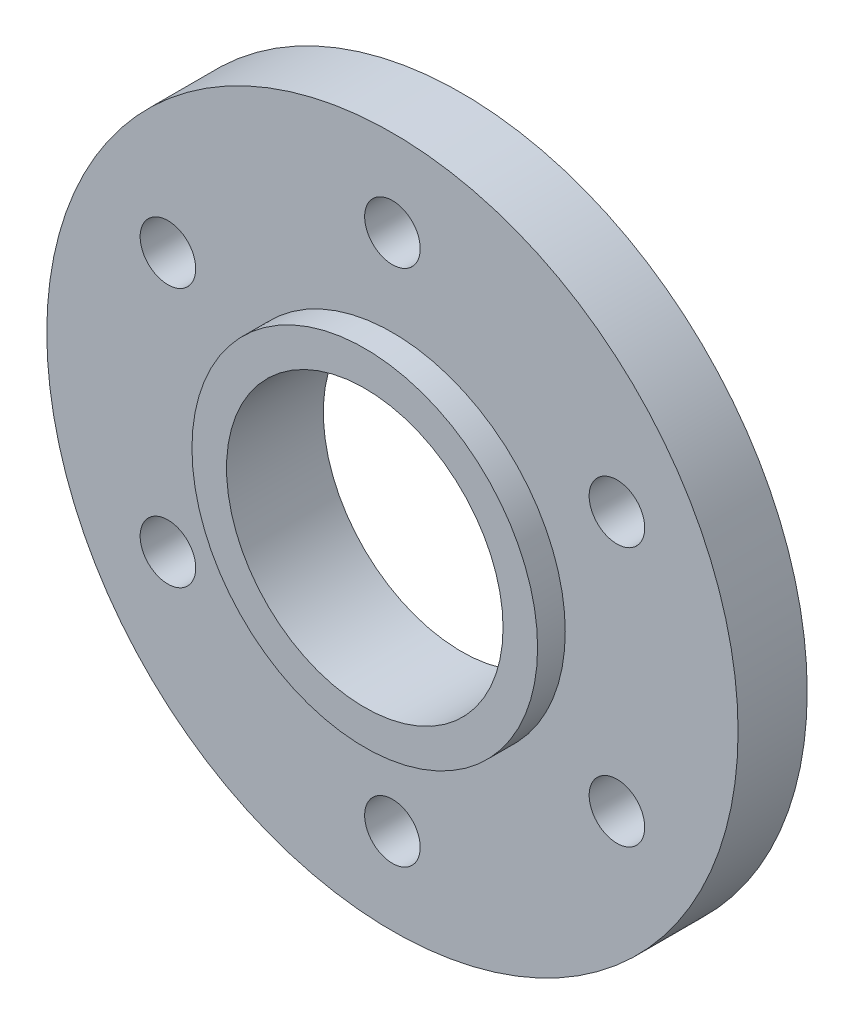
ISO-10303-21;
HEADER;
FILE_DESCRIPTION(('STEP AP214'),'2;1');
FILE_NAME('part.step','',(''),(''),'','','');
FILE_SCHEMA(('AUTOMOTIVE_DESIGN { 1 0 10303 214 1 1 1 1 }'));
ENDSEC;
DATA;
#1=APPLICATION_CONTEXT('core data for automotive mechanical design processes');
#2=APPLICATION_PROTOCOL_DEFINITION('international standard','automotive_design',2000,#1);
#3=PRODUCT_CONTEXT('',#1,'mechanical');
#4=PRODUCT('Part','Part','',(#3));
#5=PRODUCT_RELATED_PRODUCT_CATEGORY('part','',(#4));
#6=PRODUCT_DEFINITION_FORMATION('','',#4);
#7=PRODUCT_DEFINITION_CONTEXT('part definition',#1,'design');
#8=PRODUCT_DEFINITION('design','',#6,#7);
#9=PRODUCT_DEFINITION_SHAPE('','',#8);
#10=(LENGTH_UNIT() NAMED_UNIT(*) SI_UNIT(.MILLI.,.METRE.));
#11=(NAMED_UNIT(*) PLANE_ANGLE_UNIT() SI_UNIT($,.RADIAN.));
#12=(NAMED_UNIT(*) SI_UNIT($,.STERADIAN.) SOLID_ANGLE_UNIT());
#13=UNCERTAINTY_MEASURE_WITH_UNIT(LENGTH_MEASURE(1.E-05),#10,'distance_accuracy_value','');
#14=(GEOMETRIC_REPRESENTATION_CONTEXT(3) GLOBAL_UNCERTAINTY_ASSIGNED_CONTEXT((#13)) GLOBAL_UNIT_ASSIGNED_CONTEXT((#10,
#11,#12)) REPRESENTATION_CONTEXT('',''));
#15=CARTESIAN_POINT('',(0.,0.,0.));
#16=DIRECTION('',(0.,0.,1.));
#17=DIRECTION('',(1.,0.,0.));
#18=AXIS2_PLACEMENT_3D('',#15,#16,#17);
#19=CARTESIAN_POINT('',(0.,0.,6.35));
#20=DIRECTION('',(0.,0.,1.));
#21=DIRECTION('',(1.,0.,0.));
#22=AXIS2_PLACEMENT_3D('',#19,#20,#21);
#23=PLANE('',#22);
#24=CARTESIAN_POINT('',(0.,0.,6.35));
#25=DIRECTION('',(0.,0.,1.));
#26=DIRECTION('',(1.,0.,0.));
#27=AXIS2_PLACEMENT_3D('',#24,#25,#26);
#28=CIRCLE('',#27,31.75);
#29=CARTESIAN_POINT('',(31.75,0.,6.35));
#30=VERTEX_POINT('',#29);
#31=EDGE_CURVE('E10',#30,#30,#28,.T.);
#32=ORIENTED_EDGE('',*,*,#31,.T.);
#33=EDGE_LOOP('',(#32));
#34=FACE_BOUND('',#33,.T.);
#35=CARTESIAN_POINT('',(0.,23.8125,6.35));
#36=DIRECTION('',(0.,0.,1.));
#37=DIRECTION('',(1.,0.,0.));
#38=AXIS2_PLACEMENT_3D('',#35,#36,#37);
#39=CIRCLE('',#38,2.5527);
#40=CARTESIAN_POINT('',(2.5527,23.8125,6.35));
#41=VERTEX_POINT('',#40);
#42=EDGE_CURVE('E47',#41,#41,#39,.T.);
#43=ORIENTED_EDGE('',*,*,#42,.F.);
#44=EDGE_LOOP('',(#43));
#45=FACE_BOUND('',#44,.T.);
#46=CARTESIAN_POINT('',(20.6222299276176,11.9062500000012,6.35));
#47=DIRECTION('',(0.,0.,1.));
#48=DIRECTION('',(1.,0.,0.));
#49=AXIS2_PLACEMENT_3D('',#46,#47,#48);
#50=CIRCLE('',#49,2.55270000000037);
#51=CARTESIAN_POINT('',(23.174929927618,11.9062500000012,6.35));
#52=VERTEX_POINT('',#51);
#53=EDGE_CURVE('E53',#52,#52,#50,.T.);
#54=ORIENTED_EDGE('',*,*,#53,.F.);
#55=EDGE_LOOP('',(#54));
#56=FACE_BOUND('',#55,.T.);
#57=CARTESIAN_POINT('',(20.622229927619,-11.9062499999988,6.35));
#58=DIRECTION('',(0.,0.,1.));
#59=DIRECTION('',(1.,0.,0.));
#60=AXIS2_PLACEMENT_3D('',#57,#58,#59);
#61=CIRCLE('',#60,2.55270000000171);
#62=CARTESIAN_POINT('',(23.1749299276207,-11.9062499999988,6.35));
#63=VERTEX_POINT('',#62);
#64=EDGE_CURVE('E59',#63,#63,#61,.T.);
#65=ORIENTED_EDGE('',*,*,#64,.F.);
#66=EDGE_LOOP('',(#65));
#67=FACE_BOUND('',#66,.T.);
#68=CARTESIAN_POINT('',(2.70133544286504E-12,-23.8125,6.35));
#69=DIRECTION('',(0.,0.,1.));
#70=DIRECTION('',(1.,0.,0.));
#71=AXIS2_PLACEMENT_3D('',#68,#69,#70);
#72=CIRCLE('',#71,2.55270000000274);
#73=CARTESIAN_POINT('',(2.55270000000544,-23.8125,6.35));
#74=VERTEX_POINT('',#73);
#75=EDGE_CURVE('E65',#74,#74,#72,.T.);
#76=ORIENTED_EDGE('',*,*,#75,.F.);
#77=EDGE_LOOP('',(#76));
#78=FACE_BOUND('',#77,.T.);
#79=CARTESIAN_POINT('',(-20.6222299276149,-11.9062500000012,6.35));
#80=DIRECTION('',(0.,0.,1.));
#81=DIRECTION('',(1.,0.,0.));
#82=AXIS2_PLACEMENT_3D('',#79,#80,#81);
#83=CIRCLE('',#82,2.5527000000025);
#84=CARTESIAN_POINT('',(-18.0695299276124,-11.9062500000012,6.35));
#85=VERTEX_POINT('',#84);
#86=EDGE_CURVE('E71',#85,#85,#83,.T.);
#87=ORIENTED_EDGE('',*,*,#86,.F.);
#88=EDGE_LOOP('',(#87));
#89=FACE_BOUND('',#88,.T.);
#90=CARTESIAN_POINT('',(-20.6222299276163,11.9062499999988,6.35));
#91=DIRECTION('',(0.,0.,1.));
#92=DIRECTION('',(1.,0.,0.));
#93=AXIS2_PLACEMENT_3D('',#90,#91,#92);
#94=CIRCLE('',#93,2.55270000000127);
#95=CARTESIAN_POINT('',(-18.069529927615,11.9062499999988,6.35));
#96=VERTEX_POINT('',#95);
#97=EDGE_CURVE('E77',#96,#96,#94,.T.);
#98=ORIENTED_EDGE('',*,*,#97,.F.);
#99=EDGE_LOOP('',(#98));
#100=FACE_BOUND('',#99,.T.);
#101=CARTESIAN_POINT('',(0.,0.,6.35));
#102=DIRECTION('',(0.,0.,1.));
#103=DIRECTION('',(1.,0.,0.));
#104=AXIS2_PLACEMENT_3D('',#101,#102,#103);
#105=CIRCLE('',#104,15.875);
#106=CARTESIAN_POINT('',(15.875,0.,6.35));
#107=VERTEX_POINT('',#106);
#108=EDGE_CURVE('E83',#107,#107,#105,.T.);
#109=ORIENTED_EDGE('',*,*,#108,.F.);
#110=EDGE_LOOP('',(#109));
#111=FACE_BOUND('',#110,.T.);
#112=ADVANCED_FACE('F31',(#34,#45,#56,#67,#78,#89,#100,#111),#23,.T.);
#113=CARTESIAN_POINT('',(0.,0.,6.35));
#114=DIRECTION('',(0.,0.,-1.));
#115=DIRECTION('',(-1.,0.,0.));
#116=AXIS2_PLACEMENT_3D('',#113,#114,#115);
#117=CYLINDRICAL_SURFACE('',#116,31.75);
#118=ORIENTED_EDGE('',*,*,#31,.F.);
#119=EDGE_LOOP('',(#118));
#120=FACE_BOUND('',#119,.T.);
#121=CARTESIAN_POINT('',(0.,0.,0.));
#122=DIRECTION('',(0.,0.,1.));
#123=DIRECTION('',(1.,0.,0.));
#124=AXIS2_PLACEMENT_3D('',#121,#122,#123);
#125=CIRCLE('',#124,31.75);
#126=CARTESIAN_POINT('',(31.75,0.,0.));
#127=VERTEX_POINT('',#126);
#128=EDGE_CURVE('E35',#127,#127,#125,.T.);
#129=ORIENTED_EDGE('',*,*,#128,.T.);
#130=EDGE_LOOP('',(#129));
#131=FACE_BOUND('',#130,.T.);
#132=ADVANCED_FACE('F33',(#120,#131),#117,.T.);
#133=CARTESIAN_POINT('',(0.,0.,0.));
#134=DIRECTION('',(0.,0.,1.));
#135=DIRECTION('',(1.,0.,0.));
#136=AXIS2_PLACEMENT_3D('',#133,#134,#135);
#137=PLANE('',#136);
#138=CARTESIAN_POINT('',(-20.6222299276163,11.9062499999988,0.));
#139=DIRECTION('',(0.,0.,1.));
#140=DIRECTION('',(1.,0.,0.));
#141=AXIS2_PLACEMENT_3D('',#138,#139,#140);
#142=CIRCLE('',#141,2.55270000000127);
#143=CARTESIAN_POINT('',(-18.069529927615,11.9062499999988,0.));
#144=VERTEX_POINT('',#143);
#145=EDGE_CURVE('E74',#144,#144,#142,.T.);
#146=ORIENTED_EDGE('',*,*,#145,.T.);
#147=EDGE_LOOP('',(#146));
#148=FACE_BOUND('',#147,.T.);
#149=CARTESIAN_POINT('',(-20.6222299276149,-11.9062500000012,0.));
#150=DIRECTION('',(0.,0.,1.));
#151=DIRECTION('',(1.,0.,0.));
#152=AXIS2_PLACEMENT_3D('',#149,#150,#151);
#153=CIRCLE('',#152,2.5527000000025);
#154=CARTESIAN_POINT('',(-18.0695299276124,-11.9062500000012,0.));
#155=VERTEX_POINT('',#154);
#156=EDGE_CURVE('E68',#155,#155,#153,.T.);
#157=ORIENTED_EDGE('',*,*,#156,.T.);
#158=EDGE_LOOP('',(#157));
#159=FACE_BOUND('',#158,.T.);
#160=CARTESIAN_POINT('',(2.70133544286504E-12,-23.8125,0.));
#161=DIRECTION('',(0.,0.,1.));
#162=DIRECTION('',(1.,0.,0.));
#163=AXIS2_PLACEMENT_3D('',#160,#161,#162);
#164=CIRCLE('',#163,2.55270000000274);
#165=CARTESIAN_POINT('',(2.55270000000544,-23.8125,0.));
#166=VERTEX_POINT('',#165);
#167=EDGE_CURVE('E62',#166,#166,#164,.T.);
#168=ORIENTED_EDGE('',*,*,#167,.T.);
#169=EDGE_LOOP('',(#168));
#170=FACE_BOUND('',#169,.T.);
#171=CARTESIAN_POINT('',(20.622229927619,-11.9062499999988,0.));
#172=DIRECTION('',(0.,0.,1.));
#173=DIRECTION('',(1.,0.,0.));
#174=AXIS2_PLACEMENT_3D('',#171,#172,#173);
#175=CIRCLE('',#174,2.55270000000171);
#176=CARTESIAN_POINT('',(23.1749299276207,-11.9062499999988,0.));
#177=VERTEX_POINT('',#176);
#178=EDGE_CURVE('E56',#177,#177,#175,.T.);
#179=ORIENTED_EDGE('',*,*,#178,.T.);
#180=EDGE_LOOP('',(#179));
#181=FACE_BOUND('',#180,.T.);
#182=CARTESIAN_POINT('',(20.6222299276176,11.9062500000012,0.));
#183=DIRECTION('',(0.,0.,1.));
#184=DIRECTION('',(1.,0.,0.));
#185=AXIS2_PLACEMENT_3D('',#182,#183,#184);
#186=CIRCLE('',#185,2.55270000000037);
#187=CARTESIAN_POINT('',(23.174929927618,11.9062500000012,0.));
#188=VERTEX_POINT('',#187);
#189=EDGE_CURVE('E50',#188,#188,#186,.T.);
#190=ORIENTED_EDGE('',*,*,#189,.T.);
#191=EDGE_LOOP('',(#190));
#192=FACE_BOUND('',#191,.T.);
#193=CARTESIAN_POINT('',(0.,23.8125,0.));
#194=DIRECTION('',(0.,0.,1.));
#195=DIRECTION('',(1.,0.,0.));
#196=AXIS2_PLACEMENT_3D('',#193,#194,#195);
#197=CIRCLE('',#196,2.5527);
#198=CARTESIAN_POINT('',(2.5527,23.8125,0.));
#199=VERTEX_POINT('',#198);
#200=EDGE_CURVE('E46',#199,#199,#197,.T.);
#201=ORIENTED_EDGE('',*,*,#200,.T.);
#202=EDGE_LOOP('',(#201));
#203=FACE_BOUND('',#202,.T.);
#204=CARTESIAN_POINT('',(0.,0.,0.));
#205=DIRECTION('',(0.,0.,1.));
#206=DIRECTION('',(1.,0.,0.));
#207=AXIS2_PLACEMENT_3D('',#204,#205,#206);
#208=CIRCLE('',#207,12.7);
#209=CARTESIAN_POINT('',(12.7,0.,0.));
#210=VERTEX_POINT('',#209);
#211=EDGE_CURVE('E42',#210,#210,#208,.T.);
#212=ORIENTED_EDGE('',*,*,#211,.T.);
#213=EDGE_LOOP('',(#212));
#214=FACE_BOUND('',#213,.T.);
#215=ORIENTED_EDGE('',*,*,#128,.F.);
#216=EDGE_LOOP('',(#215));
#217=FACE_BOUND('',#216,.T.);
#218=ADVANCED_FACE('F114',(#148,#159,#170,#181,#192,#203,#214,#217),#137,.F.);
#219=CARTESIAN_POINT('',(0.,0.,0.));
#220=DIRECTION('',(0.,0.,1.));
#221=DIRECTION('',(1.,0.,0.));
#222=AXIS2_PLACEMENT_3D('',#219,#220,#221);
#223=CYLINDRICAL_SURFACE('',#222,12.7);
#224=ORIENTED_EDGE('',*,*,#211,.F.);
#225=EDGE_LOOP('',(#224));
#226=FACE_BOUND('',#225,.T.);
#227=CARTESIAN_POINT('',(0.,0.,8.89));
#228=DIRECTION('',(0.,0.,1.));
#229=DIRECTION('',(1.,0.,0.));
#230=AXIS2_PLACEMENT_3D('',#227,#228,#229);
#231=CIRCLE('',#230,12.7);
#232=CARTESIAN_POINT('',(12.7,0.,8.89));
#233=VERTEX_POINT('',#232);
#234=EDGE_CURVE('E86',#233,#233,#231,.T.);
#235=ORIENTED_EDGE('',*,*,#234,.T.);
#236=EDGE_LOOP('',(#235));
#237=FACE_BOUND('',#236,.T.);
#238=ADVANCED_FACE('F92',(#226,#237),#223,.F.);
#239=CARTESIAN_POINT('',(0.,23.8125,0.));
#240=DIRECTION('',(0.,0.,1.));
#241=DIRECTION('',(1.,0.,0.));
#242=AXIS2_PLACEMENT_3D('',#239,#240,#241);
#243=CYLINDRICAL_SURFACE('',#242,2.5527);
#244=ORIENTED_EDGE('',*,*,#200,.F.);
#245=EDGE_LOOP('',(#244));
#246=FACE_BOUND('',#245,.T.);
#247=ORIENTED_EDGE('',*,*,#42,.T.);
#248=EDGE_LOOP('',(#247));
#249=FACE_BOUND('',#248,.T.);
#250=ADVANCED_FACE('F124',(#246,#249),#243,.F.);
#251=CARTESIAN_POINT('',(20.6222299276176,11.9062500000012,0.));
#252=DIRECTION('',(0.,0.,1.));
#253=DIRECTION('',(1.,0.,0.));
#254=AXIS2_PLACEMENT_3D('',#251,#252,#253);
#255=CYLINDRICAL_SURFACE('',#254,2.55270000000037);
#256=ORIENTED_EDGE('',*,*,#189,.F.);
#257=EDGE_LOOP('',(#256));
#258=FACE_BOUND('',#257,.T.);
#259=ORIENTED_EDGE('',*,*,#53,.T.);
#260=EDGE_LOOP('',(#259));
#261=FACE_BOUND('',#260,.T.);
#262=ADVANCED_FACE('F145',(#258,#261),#255,.F.);
#263=CARTESIAN_POINT('',(20.622229927619,-11.9062499999988,0.));
#264=DIRECTION('',(0.,0.,1.));
#265=DIRECTION('',(1.,0.,0.));
#266=AXIS2_PLACEMENT_3D('',#263,#264,#265);
#267=CYLINDRICAL_SURFACE('',#266,2.55270000000171);
#268=ORIENTED_EDGE('',*,*,#178,.F.);
#269=EDGE_LOOP('',(#268));
#270=FACE_BOUND('',#269,.T.);
#271=ORIENTED_EDGE('',*,*,#64,.T.);
#272=EDGE_LOOP('',(#271));
#273=FACE_BOUND('',#272,.T.);
#274=ADVANCED_FACE('F169',(#270,#273),#267,.F.);
#275=CARTESIAN_POINT('',(2.70133544286504E-12,-23.8125,0.));
#276=DIRECTION('',(0.,0.,1.));
#277=DIRECTION('',(1.,0.,0.));
#278=AXIS2_PLACEMENT_3D('',#275,#276,#277);
#279=CYLINDRICAL_SURFACE('',#278,2.55270000000274);
#280=ORIENTED_EDGE('',*,*,#167,.F.);
#281=EDGE_LOOP('',(#280));
#282=FACE_BOUND('',#281,.T.);
#283=ORIENTED_EDGE('',*,*,#75,.T.);
#284=EDGE_LOOP('',(#283));
#285=FACE_BOUND('',#284,.T.);
#286=ADVANCED_FACE('F163',(#282,#285),#279,.F.);
#287=CARTESIAN_POINT('',(-20.6222299276149,-11.9062500000012,0.));
#288=DIRECTION('',(0.,0.,1.));
#289=DIRECTION('',(1.,0.,0.));
#290=AXIS2_PLACEMENT_3D('',#287,#288,#289);
#291=CYLINDRICAL_SURFACE('',#290,2.5527000000025);
#292=ORIENTED_EDGE('',*,*,#156,.F.);
#293=EDGE_LOOP('',(#292));
#294=FACE_BOUND('',#293,.T.);
#295=ORIENTED_EDGE('',*,*,#86,.T.);
#296=EDGE_LOOP('',(#295));
#297=FACE_BOUND('',#296,.T.);
#298=ADVANCED_FACE('F106',(#294,#297),#291,.F.);
#299=CARTESIAN_POINT('',(-20.6222299276163,11.9062499999988,0.));
#300=DIRECTION('',(0.,0.,1.));
#301=DIRECTION('',(1.,0.,0.));
#302=AXIS2_PLACEMENT_3D('',#299,#300,#301);
#303=CYLINDRICAL_SURFACE('',#302,2.55270000000127);
#304=ORIENTED_EDGE('',*,*,#145,.F.);
#305=EDGE_LOOP('',(#304));
#306=FACE_BOUND('',#305,.T.);
#307=ORIENTED_EDGE('',*,*,#97,.T.);
#308=EDGE_LOOP('',(#307));
#309=FACE_BOUND('',#308,.T.);
#310=ADVANCED_FACE('F97',(#306,#309),#303,.F.);
#311=CARTESIAN_POINT('',(0.,0.,8.89));
#312=DIRECTION('',(0.,0.,1.));
#313=DIRECTION('',(1.,0.,0.));
#314=AXIS2_PLACEMENT_3D('',#311,#312,#313);
#315=PLANE('',#314);
#316=CARTESIAN_POINT('',(0.,0.,8.89));
#317=DIRECTION('',(0.,0.,1.));
#318=DIRECTION('',(1.,0.,0.));
#319=AXIS2_PLACEMENT_3D('',#316,#317,#318);
#320=CIRCLE('',#319,15.875);
#321=CARTESIAN_POINT('',(15.875,0.,8.89));
#322=VERTEX_POINT('',#321);
#323=EDGE_CURVE('E80',#322,#322,#320,.T.);
#324=ORIENTED_EDGE('',*,*,#323,.T.);
#325=EDGE_LOOP('',(#324));
#326=FACE_BOUND('',#325,.T.);
#327=ORIENTED_EDGE('',*,*,#234,.F.);
#328=EDGE_LOOP('',(#327));
#329=FACE_BOUND('',#328,.T.);
#330=ADVANCED_FACE('F94',(#326,#329),#315,.T.);
#331=CARTESIAN_POINT('',(0.,0.,8.89));
#332=DIRECTION('',(0.,0.,-1.));
#333=DIRECTION('',(-1.,0.,0.));
#334=AXIS2_PLACEMENT_3D('',#331,#332,#333);
#335=CYLINDRICAL_SURFACE('',#334,15.875);
#336=ORIENTED_EDGE('',*,*,#323,.F.);
#337=EDGE_LOOP('',(#336));
#338=FACE_BOUND('',#337,.T.);
#339=ORIENTED_EDGE('',*,*,#108,.T.);
#340=EDGE_LOOP('',(#339));
#341=FACE_BOUND('',#340,.T.);
#342=ADVANCED_FACE('F96',(#338,#341),#335,.T.);
#343=CLOSED_SHELL('',(#112,#132,#218,#238,#250,#262,#274,#286,#298,#310,#330,#342));
#344=MANIFOLD_SOLID_BREP('B2',#343);
#345=ADVANCED_BREP_SHAPE_REPRESENTATION('',(#18,#344),#14);
#346=SHAPE_DEFINITION_REPRESENTATION(#9,#345);
ENDSEC;
END-ISO-10303-21;
